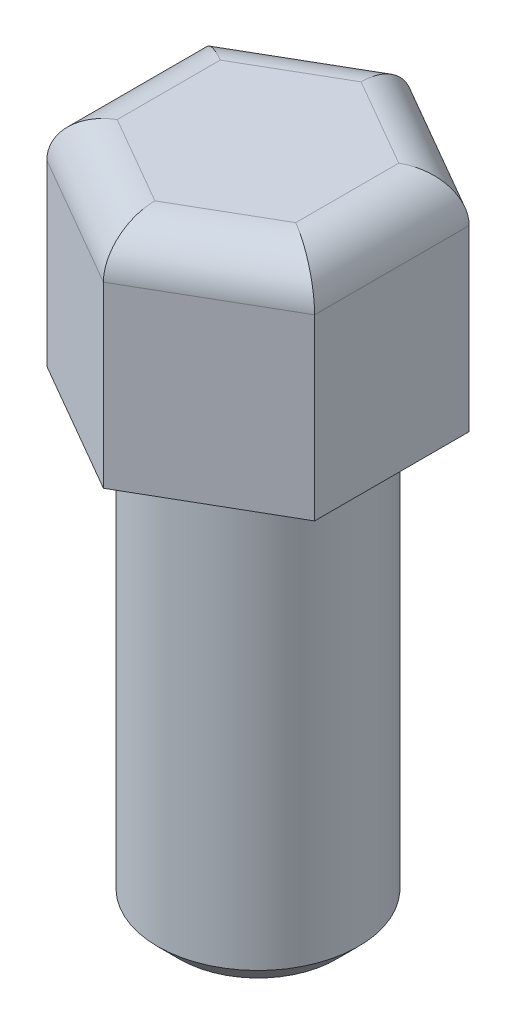
ISO-10303-21;
HEADER;
FILE_DESCRIPTION(('STEP AP214'),'2;1');
FILE_NAME('part.step','',(''),(''),'','','');
FILE_SCHEMA(('AUTOMOTIVE_DESIGN { 1 0 10303 214 1 1 1 1 }'));
ENDSEC;
DATA;
#1=APPLICATION_CONTEXT('core data for automotive mechanical design processes');
#2=APPLICATION_PROTOCOL_DEFINITION('international standard','automotive_design',2000,#1);
#3=PRODUCT_CONTEXT('',#1,'mechanical');
#4=PRODUCT('Part','Part','',(#3));
#5=PRODUCT_RELATED_PRODUCT_CATEGORY('part','',(#4));
#6=PRODUCT_DEFINITION_FORMATION('','',#4);
#7=PRODUCT_DEFINITION_CONTEXT('part definition',#1,'design');
#8=PRODUCT_DEFINITION('design','',#6,#7);
#9=PRODUCT_DEFINITION_SHAPE('','',#8);
#10=(LENGTH_UNIT() NAMED_UNIT(*) SI_UNIT(.MILLI.,.METRE.));
#11=(NAMED_UNIT(*) PLANE_ANGLE_UNIT() SI_UNIT($,.RADIAN.));
#12=(NAMED_UNIT(*) SI_UNIT($,.STERADIAN.) SOLID_ANGLE_UNIT());
#13=UNCERTAINTY_MEASURE_WITH_UNIT(LENGTH_MEASURE(1.E-05),#10,'distance_accuracy_value','');
#14=(GEOMETRIC_REPRESENTATION_CONTEXT(3) GLOBAL_UNCERTAINTY_ASSIGNED_CONTEXT((#13)) GLOBAL_UNIT_ASSIGNED_CONTEXT((#10,
#11,#12)) REPRESENTATION_CONTEXT('',''));
#15=CARTESIAN_POINT('',(0.,0.,0.));
#16=DIRECTION('',(0.,0.,1.));
#17=DIRECTION('',(1.,0.,0.));
#18=AXIS2_PLACEMENT_3D('',#15,#16,#17);
#19=CARTESIAN_POINT('',(0.,20.,0.));
#20=DIRECTION('',(0.,-1.,0.));
#21=DIRECTION('',(0.,0.,-1.));
#22=AXIS2_PLACEMENT_3D('',#19,#20,#21);
#23=CYLINDRICAL_SURFACE('',#22,4.5);
#24=CARTESIAN_POINT('',(0.,19.,0.));
#25=DIRECTION('',(0.,1.,0.));
#26=DIRECTION('',(0.,0.,1.));
#27=AXIS2_PLACEMENT_3D('',#24,#25,#26);
#28=CIRCLE('',#27,4.5);
#29=CARTESIAN_POINT('',(0.,19.,4.5));
#30=VERTEX_POINT('',#29);
#31=EDGE_CURVE('E151',#30,#30,#28,.F.);
#32=ORIENTED_EDGE('',*,*,#31,.T.);
#33=EDGE_LOOP('',(#32));
#34=FACE_BOUND('',#33,.T.);
#35=CARTESIAN_POINT('',(0.,1.,0.));
#36=DIRECTION('',(0.,1.,0.));
#37=DIRECTION('',(0.,0.,1.));
#38=AXIS2_PLACEMENT_3D('',#35,#36,#37);
#39=CIRCLE('',#38,4.5);
#40=CARTESIAN_POINT('',(0.,1.,4.5));
#41=VERTEX_POINT('',#40);
#42=EDGE_CURVE('E148',#41,#41,#39,.T.);
#43=ORIENTED_EDGE('',*,*,#42,.T.);
#44=EDGE_LOOP('',(#43));
#45=FACE_BOUND('',#44,.T.);
#46=ADVANCED_FACE('F32',(#34,#45),#23,.T.);
#47=CARTESIAN_POINT('',(0.,0.,0.));
#48=DIRECTION('',(0.,1.,0.));
#49=DIRECTION('',(0.,0.,1.));
#50=AXIS2_PLACEMENT_3D('',#47,#48,#49);
#51=PLANE('',#50);
#52=CARTESIAN_POINT('',(0.,0.,0.));
#53=DIRECTION('',(0.,1.,0.));
#54=DIRECTION('',(0.,0.,1.));
#55=AXIS2_PLACEMENT_3D('',#52,#53,#54);
#56=CIRCLE('',#55,3.49999999999999);
#57=CARTESIAN_POINT('',(0.,0.,3.49999999999999));
#58=VERTEX_POINT('',#57);
#59=EDGE_CURVE('E154',#58,#58,#56,.F.);
#60=ORIENTED_EDGE('',*,*,#59,.T.);
#61=EDGE_LOOP('',(#60));
#62=FACE_BOUND('',#61,.T.);
#63=ADVANCED_FACE('F233',(#62),#51,.F.);
#64=CARTESIAN_POINT('',(6.,30.,3.46410161513775));
#65=DIRECTION('',(-1.,0.,0.));
#66=DIRECTION('',(0.,0.,1.));
#67=AXIS2_PLACEMENT_3D('',#64,#65,#66);
#68=PLANE('',#67);
#69=DIRECTION('',(0.,-1.,0.));
#70=VECTOR('',#69,1.);
#71=CARTESIAN_POINT('',(6.,30.,-3.46410161513776));
#72=LINE('',#71,#70);
#73=CARTESIAN_POINT('',(6.,28.,-3.46410161513776));
#74=VERTEX_POINT('',#73);
#75=CARTESIAN_POINT('',(6.,20.,-3.46410161513776));
#76=VERTEX_POINT('',#75);
#77=EDGE_CURVE('E101',#74,#76,#72,.T.);
#78=ORIENTED_EDGE('',*,*,#77,.F.);
#79=DIRECTION('',(0.,0.,-1.));
#80=VECTOR('',#79,1.);
#81=CARTESIAN_POINT('',(6.,28.,3.46410161513775));
#82=LINE('',#81,#80);
#83=CARTESIAN_POINT('',(6.,28.,3.46410161513775));
#84=VERTEX_POINT('',#83);
#85=EDGE_CURVE('E177',#74,#84,#82,.F.);
#86=ORIENTED_EDGE('',*,*,#85,.T.);
#87=DIRECTION('',(0.,-1.,0.));
#88=VECTOR('',#87,1.);
#89=CARTESIAN_POINT('',(6.,30.,3.46410161513775));
#90=LINE('',#89,#88);
#91=CARTESIAN_POINT('',(6.,20.,3.46410161513775));
#92=VERTEX_POINT('',#91);
#93=EDGE_CURVE('E123',#84,#92,#90,.T.);
#94=ORIENTED_EDGE('',*,*,#93,.T.);
#95=DIRECTION('',(0.,0.,-1.));
#96=VECTOR('',#95,1.);
#97=CARTESIAN_POINT('',(6.,20.,3.46410161513775));
#98=LINE('',#97,#96);
#99=EDGE_CURVE('E116',#92,#76,#98,.T.);
#100=ORIENTED_EDGE('',*,*,#99,.T.);
#101=EDGE_LOOP('',(#78,#86,#94,#100));
#102=FACE_BOUND('',#101,.T.);
#103=ADVANCED_FACE('F121',(#102),#68,.F.);
#104=CARTESIAN_POINT('',(6.,30.,-3.46410161513776));
#105=DIRECTION('',(-0.5,0.,0.866025403784439));
#106=DIRECTION('',(0.866025403784439,0.,0.5));
#107=AXIS2_PLACEMENT_3D('',#104,#105,#106);
#108=PLANE('',#107);
#109=DIRECTION('',(0.,-1.,0.));
#110=VECTOR('',#109,1.);
#111=CARTESIAN_POINT('',(0.,30.,-6.92820323027551));
#112=LINE('',#111,#110);
#113=CARTESIAN_POINT('',(0.,28.,-6.92820323027551));
#114=VERTEX_POINT('',#113);
#115=CARTESIAN_POINT('',(0.,20.,-6.92820323027551));
#116=VERTEX_POINT('',#115);
#117=EDGE_CURVE('E110',#114,#116,#112,.T.);
#118=ORIENTED_EDGE('',*,*,#117,.F.);
#119=DIRECTION('',(-0.866025403784439,0.,-0.5));
#120=VECTOR('',#119,1.);
#121=CARTESIAN_POINT('',(6.,28.,-3.46410161513776));
#122=LINE('',#121,#120);
#123=EDGE_CURVE('E41',#114,#74,#122,.F.);
#124=ORIENTED_EDGE('',*,*,#123,.T.);
#125=ORIENTED_EDGE('',*,*,#77,.T.);
#126=DIRECTION('',(-0.866025403784439,0.,-0.5));
#127=VECTOR('',#126,1.);
#128=CARTESIAN_POINT('',(6.,20.,-3.46410161513776));
#129=LINE('',#128,#127);
#130=EDGE_CURVE('E104',#76,#116,#129,.T.);
#131=ORIENTED_EDGE('',*,*,#130,.T.);
#132=EDGE_LOOP('',(#118,#124,#125,#131));
#133=FACE_BOUND('',#132,.T.);
#134=ADVANCED_FACE('F103',(#133),#108,.F.);
#135=CARTESIAN_POINT('',(0.,30.,-6.92820323027551));
#136=DIRECTION('',(0.5,0.,0.866025403784438));
#137=DIRECTION('',(0.866025403784438,0.,-0.5));
#138=AXIS2_PLACEMENT_3D('',#135,#136,#137);
#139=PLANE('',#138);
#140=DIRECTION('',(0.,-1.,0.));
#141=VECTOR('',#140,1.);
#142=CARTESIAN_POINT('',(-6.,30.,-3.46410161513775));
#143=LINE('',#142,#141);
#144=CARTESIAN_POINT('',(-6.,28.,-3.46410161513775));
#145=VERTEX_POINT('',#144);
#146=CARTESIAN_POINT('',(-6.,20.,-3.46410161513775));
#147=VERTEX_POINT('',#146);
#148=EDGE_CURVE('E143',#145,#147,#143,.T.);
#149=ORIENTED_EDGE('',*,*,#148,.F.);
#150=DIRECTION('',(-0.866025403784438,0.,0.5));
#151=VECTOR('',#150,1.);
#152=CARTESIAN_POINT('',(0.,28.,-6.92820323027551));
#153=LINE('',#152,#151);
#154=EDGE_CURVE('E11',#145,#114,#153,.F.);
#155=ORIENTED_EDGE('',*,*,#154,.T.);
#156=ORIENTED_EDGE('',*,*,#117,.T.);
#157=DIRECTION('',(-0.866025403784438,0.,0.5));
#158=VECTOR('',#157,1.);
#159=CARTESIAN_POINT('',(0.,20.,-6.92820323027551));
#160=LINE('',#159,#158);
#161=EDGE_CURVE('E119',#116,#147,#160,.T.);
#162=ORIENTED_EDGE('',*,*,#161,.T.);
#163=EDGE_LOOP('',(#149,#155,#156,#162));
#164=FACE_BOUND('',#163,.T.);
#165=ADVANCED_FACE('F338',(#164),#139,.F.);
#166=CARTESIAN_POINT('',(-6.,30.,-3.46410161513775));
#167=DIRECTION('',(1.,0.,0.));
#168=DIRECTION('',(0.,0.,-1.));
#169=AXIS2_PLACEMENT_3D('',#166,#167,#168);
#170=PLANE('',#169);
#171=DIRECTION('',(0.,-1.,0.));
#172=VECTOR('',#171,1.);
#173=CARTESIAN_POINT('',(-6.,30.,3.46410161513776));
#174=LINE('',#173,#172);
#175=CARTESIAN_POINT('',(-6.,28.,3.46410161513776));
#176=VERTEX_POINT('',#175);
#177=CARTESIAN_POINT('',(-6.,20.,3.46410161513776));
#178=VERTEX_POINT('',#177);
#179=EDGE_CURVE('E141',#176,#178,#174,.T.);
#180=ORIENTED_EDGE('',*,*,#179,.F.);
#181=DIRECTION('',(0.,0.,1.));
#182=VECTOR('',#181,1.);
#183=CARTESIAN_POINT('',(-6.,28.,-3.46410161513775));
#184=LINE('',#183,#182);
#185=EDGE_CURVE('E170',#176,#145,#184,.F.);
#186=ORIENTED_EDGE('',*,*,#185,.T.);
#187=ORIENTED_EDGE('',*,*,#148,.T.);
#188=DIRECTION('',(0.,0.,1.));
#189=VECTOR('',#188,1.);
#190=CARTESIAN_POINT('',(-6.,20.,-3.46410161513775));
#191=LINE('',#190,#189);
#192=EDGE_CURVE('E130',#147,#178,#191,.T.);
#193=ORIENTED_EDGE('',*,*,#192,.T.);
#194=EDGE_LOOP('',(#180,#186,#187,#193));
#195=FACE_BOUND('',#194,.T.);
#196=ADVANCED_FACE('F215',(#195),#170,.F.);
#197=CARTESIAN_POINT('',(-6.,30.,3.46410161513776));
#198=DIRECTION('',(0.5,0.,-0.866025403784439));
#199=DIRECTION('',(-0.866025403784439,0.,-0.5));
#200=AXIS2_PLACEMENT_3D('',#197,#198,#199);
#201=PLANE('',#200);
#202=DIRECTION('',(0.,-1.,0.));
#203=VECTOR('',#202,1.);
#204=CARTESIAN_POINT('',(0.,30.,6.92820323027551));
#205=LINE('',#204,#203);
#206=CARTESIAN_POINT('',(0.,28.,6.92820323027551));
#207=VERTEX_POINT('',#206);
#208=CARTESIAN_POINT('',(0.,20.,6.92820323027551));
#209=VERTEX_POINT('',#208);
#210=EDGE_CURVE('E139',#207,#209,#205,.T.);
#211=ORIENTED_EDGE('',*,*,#210,.F.);
#212=DIRECTION('',(0.866025403784439,0.,0.5));
#213=VECTOR('',#212,1.);
#214=CARTESIAN_POINT('',(-6.,28.,3.46410161513776));
#215=LINE('',#214,#213);
#216=EDGE_CURVE('E173',#207,#176,#215,.F.);
#217=ORIENTED_EDGE('',*,*,#216,.T.);
#218=ORIENTED_EDGE('',*,*,#179,.T.);
#219=DIRECTION('',(0.866025403784439,0.,0.5));
#220=VECTOR('',#219,1.);
#221=CARTESIAN_POINT('',(-6.,20.,3.46410161513776));
#222=LINE('',#221,#220);
#223=EDGE_CURVE('E133',#178,#209,#222,.T.);
#224=ORIENTED_EDGE('',*,*,#223,.T.);
#225=EDGE_LOOP('',(#211,#217,#218,#224));
#226=FACE_BOUND('',#225,.T.);
#227=ADVANCED_FACE('F212',(#226),#201,.F.);
#228=CARTESIAN_POINT('',(0.,30.,6.92820323027551));
#229=DIRECTION('',(-0.5,0.,-0.866025403784438));
#230=DIRECTION('',(-0.866025403784439,0.,0.5));
#231=AXIS2_PLACEMENT_3D('',#228,#229,#230);
#232=PLANE('',#231);
#233=ORIENTED_EDGE('',*,*,#93,.F.);
#234=DIRECTION('',(0.866025403784439,0.,-0.5));
#235=VECTOR('',#234,1.);
#236=CARTESIAN_POINT('',(0.,28.,6.92820323027551));
#237=LINE('',#236,#235);
#238=EDGE_CURVE('E175',#84,#207,#237,.F.);
#239=ORIENTED_EDGE('',*,*,#238,.T.);
#240=ORIENTED_EDGE('',*,*,#210,.T.);
#241=DIRECTION('',(0.866025403784438,0.,-0.5));
#242=VECTOR('',#241,1.);
#243=CARTESIAN_POINT('',(0.,20.,6.92820323027551));
#244=LINE('',#243,#242);
#245=EDGE_CURVE('E136',#209,#92,#244,.T.);
#246=ORIENTED_EDGE('',*,*,#245,.T.);
#247=EDGE_LOOP('',(#233,#239,#240,#246));
#248=FACE_BOUND('',#247,.T.);
#249=ADVANCED_FACE('F315',(#248),#232,.F.);
#250=CARTESIAN_POINT('',(0.,30.,0.));
#251=DIRECTION('',(0.,1.,0.));
#252=DIRECTION('',(0.,0.,1.));
#253=AXIS2_PLACEMENT_3D('',#250,#251,#252);
#254=PLANE('',#253);
#255=DIRECTION('',(-0.866025403784438,0.,0.5));
#256=VECTOR('',#255,1.);
#257=CARTESIAN_POINT('',(-5.,30.,-1.73205080756887));
#258=LINE('',#257,#256);
#259=CARTESIAN_POINT('',(0.,30.,-4.61880215351701));
#260=VERTEX_POINT('',#259);
#261=CARTESIAN_POINT('',(-4.,30.,-2.3094010767585));
#262=VERTEX_POINT('',#261);
#263=EDGE_CURVE('E157',#260,#262,#258,.T.);
#264=ORIENTED_EDGE('',*,*,#263,.T.);
#265=DIRECTION('',(0.,0.,1.));
#266=VECTOR('',#265,1.);
#267=CARTESIAN_POINT('',(-4.,30.,3.46410161513776));
#268=LINE('',#267,#266);
#269=CARTESIAN_POINT('',(-4.,30.,2.30940107675851));
#270=VERTEX_POINT('',#269);
#271=EDGE_CURVE('E167',#262,#270,#268,.T.);
#272=ORIENTED_EDGE('',*,*,#271,.T.);
#273=DIRECTION('',(0.866025403784439,0.,0.5));
#274=VECTOR('',#273,1.);
#275=CARTESIAN_POINT('',(1.,30.,5.19615242270663));
#276=LINE('',#275,#274);
#277=CARTESIAN_POINT('',(0.,30.,4.61880215351701));
#278=VERTEX_POINT('',#277);
#279=EDGE_CURVE('E165',#270,#278,#276,.T.);
#280=ORIENTED_EDGE('',*,*,#279,.T.);
#281=DIRECTION('',(0.866025403784439,0.,-0.5));
#282=VECTOR('',#281,1.);
#283=CARTESIAN_POINT('',(5.,30.,1.73205080756888));
#284=LINE('',#283,#282);
#285=CARTESIAN_POINT('',(4.,30.,2.3094010767585));
#286=VERTEX_POINT('',#285);
#287=EDGE_CURVE('E163',#278,#286,#284,.T.);
#288=ORIENTED_EDGE('',*,*,#287,.T.);
#289=DIRECTION('',(0.,0.,-1.));
#290=VECTOR('',#289,1.);
#291=CARTESIAN_POINT('',(4.,30.,-3.46410161513776));
#292=LINE('',#291,#290);
#293=CARTESIAN_POINT('',(4.,30.,-2.3094010767585));
#294=VERTEX_POINT('',#293);
#295=EDGE_CURVE('E161',#286,#294,#292,.T.);
#296=ORIENTED_EDGE('',*,*,#295,.T.);
#297=DIRECTION('',(-0.866025403784439,0.,-0.5));
#298=VECTOR('',#297,1.);
#299=CARTESIAN_POINT('',(-1.,30.,-5.19615242270663));
#300=LINE('',#299,#298);
#301=EDGE_CURVE('E159',#294,#260,#300,.T.);
#302=ORIENTED_EDGE('',*,*,#301,.T.);
#303=EDGE_LOOP('',(#264,#272,#280,#288,#296,#302));
#304=FACE_BOUND('',#303,.T.);
#305=ADVANCED_FACE('F201',(#304),#254,.T.);
#306=CARTESIAN_POINT('',(0.,20.,0.));
#307=DIRECTION('',(0.,1.,0.));
#308=DIRECTION('',(0.,0.,1.));
#309=AXIS2_PLACEMENT_3D('',#306,#307,#308);
#310=PLANE('',#309);
#311=CARTESIAN_POINT('',(0.,20.,0.));
#312=DIRECTION('',(0.,1.,0.));
#313=DIRECTION('',(0.,0.,1.));
#314=AXIS2_PLACEMENT_3D('',#311,#312,#313);
#315=CIRCLE('',#314,5.5);
#316=CARTESIAN_POINT('',(0.,20.,5.5));
#317=VERTEX_POINT('',#316);
#318=EDGE_CURVE('E109',#317,#317,#315,.T.);
#319=ORIENTED_EDGE('',*,*,#318,.T.);
#320=EDGE_LOOP('',(#319));
#321=FACE_BOUND('',#320,.T.);
#322=ORIENTED_EDGE('',*,*,#99,.F.);
#323=ORIENTED_EDGE('',*,*,#245,.F.);
#324=ORIENTED_EDGE('',*,*,#223,.F.);
#325=ORIENTED_EDGE('',*,*,#192,.F.);
#326=ORIENTED_EDGE('',*,*,#161,.F.);
#327=ORIENTED_EDGE('',*,*,#130,.F.);
#328=EDGE_LOOP('',(#322,#323,#324,#325,#326,#327));
#329=FACE_BOUND('',#328,.T.);
#330=ADVANCED_FACE('F114',(#321,#329),#310,.F.);
#331=CARTESIAN_POINT('',(0.,20.,0.));
#332=DIRECTION('',(0.,1.,0.));
#333=DIRECTION('',(0.,0.,1.));
#334=AXIS2_PLACEMENT_3D('',#331,#332,#333);
#335=CONICAL_SURFACE('',#334,5.5,0.785398163397443);
#336=ORIENTED_EDGE('',*,*,#31,.F.);
#337=EDGE_LOOP('',(#336));
#338=FACE_BOUND('',#337,.T.);
#339=ORIENTED_EDGE('',*,*,#318,.F.);
#340=EDGE_LOOP('',(#339));
#341=FACE_BOUND('',#340,.T.);
#342=ADVANCED_FACE('F244',(#338,#341),#335,.T.);
#343=CARTESIAN_POINT('',(0.,1.,0.));
#344=DIRECTION('',(0.,1.,0.));
#345=DIRECTION('',(0.,0.,1.));
#346=AXIS2_PLACEMENT_3D('',#343,#344,#345);
#347=CONICAL_SURFACE('',#346,4.5,0.78539816339745);
#348=ORIENTED_EDGE('',*,*,#59,.F.);
#349=EDGE_LOOP('',(#348));
#350=FACE_BOUND('',#349,.T.);
#351=ORIENTED_EDGE('',*,*,#42,.F.);
#352=EDGE_LOOP('',(#351));
#353=FACE_BOUND('',#352,.T.);
#354=ADVANCED_FACE('F231',(#350,#353),#347,.T.);
#355=CARTESIAN_POINT('',(4.,28.,0.));
#356=DIRECTION('',(0.,0.,1.));
#357=DIRECTION('',(1.,0.,0.));
#358=AXIS2_PLACEMENT_3D('',#355,#356,#357);
#359=CYLINDRICAL_SURFACE('',#358,2.);
#360=CARTESIAN_POINT('',(4.,28.,2.3094010767585));
#361=DIRECTION('',(-0.5,0.,0.866025403784439));
#362=DIRECTION('',(0.866025403784439,0.,0.5));
#363=AXIS2_PLACEMENT_3D('',#360,#361,#362);
#364=ELLIPSE('',#363,2.3094010767585,2.);
#365=EDGE_CURVE('E127',#84,#286,#364,.T.);
#366=ORIENTED_EDGE('',*,*,#365,.F.);
#367=ORIENTED_EDGE('',*,*,#85,.F.);
#368=CARTESIAN_POINT('',(4.,28.,-2.3094010767585));
#369=DIRECTION('',(0.5,0.,0.866025403784439));
#370=DIRECTION('',(0.866025403784439,0.,-0.5));
#371=AXIS2_PLACEMENT_3D('',#368,#369,#370);
#372=ELLIPSE('',#371,2.3094010767585,2.);
#373=EDGE_CURVE('E36',#294,#74,#372,.F.);
#374=ORIENTED_EDGE('',*,*,#373,.F.);
#375=ORIENTED_EDGE('',*,*,#295,.F.);
#376=EDGE_LOOP('',(#366,#367,#374,#375));
#377=FACE_BOUND('',#376,.T.);
#378=ADVANCED_FACE('F34',(#377),#359,.T.);
#379=CARTESIAN_POINT('',(2.,28.,-3.46410161513776));
#380=DIRECTION('',(0.866025403784439,0.,0.5));
#381=DIRECTION('',(0.5,0.,-0.866025403784439));
#382=AXIS2_PLACEMENT_3D('',#379,#380,#381);
#383=CYLINDRICAL_SURFACE('',#382,2.);
#384=ORIENTED_EDGE('',*,*,#373,.T.);
#385=ORIENTED_EDGE('',*,*,#123,.F.);
#386=CARTESIAN_POINT('',(0.,28.,-4.61880215351701));
#387=DIRECTION('',(1.,0.,0.));
#388=DIRECTION('',(0.,0.,-1.));
#389=AXIS2_PLACEMENT_3D('',#386,#387,#388);
#390=ELLIPSE('',#389,2.3094010767585,2.);
#391=EDGE_CURVE('E187',#260,#114,#390,.F.);
#392=ORIENTED_EDGE('',*,*,#391,.F.);
#393=ORIENTED_EDGE('',*,*,#301,.F.);
#394=EDGE_LOOP('',(#384,#385,#392,#393));
#395=FACE_BOUND('',#394,.T.);
#396=ADVANCED_FACE('F224',(#395),#383,.T.);
#397=CARTESIAN_POINT('',(2.,28.,3.46410161513776));
#398=DIRECTION('',(-0.866025403784439,0.,0.5));
#399=DIRECTION('',(0.5,0.,0.866025403784438));
#400=AXIS2_PLACEMENT_3D('',#397,#398,#399);
#401=CYLINDRICAL_SURFACE('',#400,2.);
#402=ORIENTED_EDGE('',*,*,#365,.T.);
#403=ORIENTED_EDGE('',*,*,#287,.F.);
#404=CARTESIAN_POINT('',(0.,28.,4.61880215351701));
#405=DIRECTION('',(-1.,0.,0.));
#406=DIRECTION('',(0.,0.,1.));
#407=AXIS2_PLACEMENT_3D('',#404,#405,#406);
#408=ELLIPSE('',#407,2.3094010767585,2.);
#409=EDGE_CURVE('E184',#207,#278,#408,.T.);
#410=ORIENTED_EDGE('',*,*,#409,.F.);
#411=ORIENTED_EDGE('',*,*,#238,.F.);
#412=EDGE_LOOP('',(#402,#403,#410,#411));
#413=FACE_BOUND('',#412,.T.);
#414=ADVANCED_FACE('F194',(#413),#401,.T.);
#415=CARTESIAN_POINT('',(-2.,28.,-3.46410161513775));
#416=DIRECTION('',(0.866025403784438,0.,-0.5));
#417=DIRECTION('',(-0.5,0.,-0.866025403784438));
#418=AXIS2_PLACEMENT_3D('',#415,#416,#417);
#419=CYLINDRICAL_SURFACE('',#418,2.);
#420=ORIENTED_EDGE('',*,*,#391,.T.);
#421=ORIENTED_EDGE('',*,*,#154,.F.);
#422=CARTESIAN_POINT('',(-4.,28.,-2.3094010767585));
#423=DIRECTION('',(0.5,0.,-0.866025403784439));
#424=DIRECTION('',(0.866025403784439,0.,0.5));
#425=AXIS2_PLACEMENT_3D('',#422,#423,#424);
#426=ELLIPSE('',#425,2.3094010767585,2.);
#427=EDGE_CURVE('E182',#262,#145,#426,.F.);
#428=ORIENTED_EDGE('',*,*,#427,.F.);
#429=ORIENTED_EDGE('',*,*,#263,.F.);
#430=EDGE_LOOP('',(#420,#421,#428,#429));
#431=FACE_BOUND('',#430,.T.);
#432=ADVANCED_FACE('F222',(#431),#419,.T.);
#433=CARTESIAN_POINT('',(-2.,28.,3.46410161513776));
#434=DIRECTION('',(-0.866025403784439,0.,-0.5));
#435=DIRECTION('',(-0.5,0.,0.866025403784439));
#436=AXIS2_PLACEMENT_3D('',#433,#434,#435);
#437=CYLINDRICAL_SURFACE('',#436,2.);
#438=ORIENTED_EDGE('',*,*,#409,.T.);
#439=ORIENTED_EDGE('',*,*,#279,.F.);
#440=CARTESIAN_POINT('',(-4.,28.,2.30940107675851));
#441=DIRECTION('',(-0.5,0.,-0.866025403784439));
#442=DIRECTION('',(-0.866025403784439,0.,0.5));
#443=AXIS2_PLACEMENT_3D('',#440,#441,#442);
#444=ELLIPSE('',#443,2.3094010767585,2.);
#445=EDGE_CURVE('E180',#176,#270,#444,.T.);
#446=ORIENTED_EDGE('',*,*,#445,.F.);
#447=ORIENTED_EDGE('',*,*,#216,.F.);
#448=EDGE_LOOP('',(#438,#439,#446,#447));
#449=FACE_BOUND('',#448,.T.);
#450=ADVANCED_FACE('F207',(#449),#437,.T.);
#451=CARTESIAN_POINT('',(-4.,28.,0.));
#452=DIRECTION('',(0.,0.,-1.));
#453=DIRECTION('',(-1.,0.,0.));
#454=AXIS2_PLACEMENT_3D('',#451,#452,#453);
#455=CYLINDRICAL_SURFACE('',#454,2.);
#456=ORIENTED_EDGE('',*,*,#427,.T.);
#457=ORIENTED_EDGE('',*,*,#185,.F.);
#458=ORIENTED_EDGE('',*,*,#445,.T.);
#459=ORIENTED_EDGE('',*,*,#271,.F.);
#460=EDGE_LOOP('',(#456,#457,#458,#459));
#461=FACE_BOUND('',#460,.T.);
#462=ADVANCED_FACE('F218',(#461),#455,.T.);
#463=CLOSED_SHELL('',(#46,#63,#103,#134,#165,#196,#227,#249,#305,#330,#342,#354,#378,#396,#414,
#432,#450,#462));
#464=MANIFOLD_SOLID_BREP('B2',#463);
#465=ADVANCED_BREP_SHAPE_REPRESENTATION('',(#18,#464),#14);
#466=SHAPE_DEFINITION_REPRESENTATION(#9,#465);
ENDSEC;
END-ISO-10303-21;
